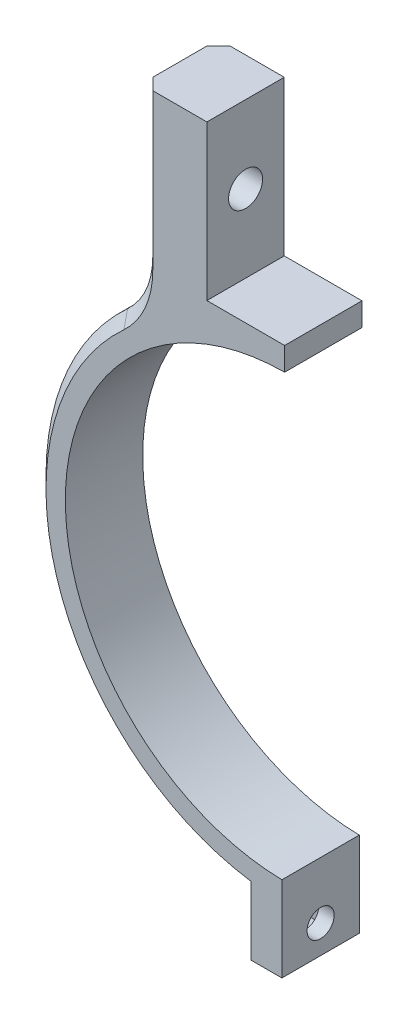
ISO-10303-21;
HEADER;
FILE_DESCRIPTION(('STEP AP214'),'2;1');
FILE_NAME('part.step','',(''),(''),'','','');
FILE_SCHEMA(('AUTOMOTIVE_DESIGN { 1 0 10303 214 1 1 1 1 }'));
ENDSEC;
DATA;
#1=APPLICATION_CONTEXT('core data for automotive mechanical design processes');
#2=APPLICATION_PROTOCOL_DEFINITION('international standard','automotive_design',2000,#1);
#3=PRODUCT_CONTEXT('',#1,'mechanical');
#4=PRODUCT('Part','Part','',(#3));
#5=PRODUCT_RELATED_PRODUCT_CATEGORY('part','',(#4));
#6=PRODUCT_DEFINITION_FORMATION('','',#4);
#7=PRODUCT_DEFINITION_CONTEXT('part definition',#1,'design');
#8=PRODUCT_DEFINITION('design','',#6,#7);
#9=PRODUCT_DEFINITION_SHAPE('','',#8);
#10=(LENGTH_UNIT() NAMED_UNIT(*) SI_UNIT(.MILLI.,.METRE.));
#11=(NAMED_UNIT(*) PLANE_ANGLE_UNIT() SI_UNIT($,.RADIAN.));
#12=(NAMED_UNIT(*) SI_UNIT($,.STERADIAN.) SOLID_ANGLE_UNIT());
#13=UNCERTAINTY_MEASURE_WITH_UNIT(LENGTH_MEASURE(1.E-05),#10,'distance_accuracy_value','');
#14=(GEOMETRIC_REPRESENTATION_CONTEXT(3) GLOBAL_UNCERTAINTY_ASSIGNED_CONTEXT((#13)) GLOBAL_UNIT_ASSIGNED_CONTEXT((#10,
#11,#12)) REPRESENTATION_CONTEXT('',''));
#15=CARTESIAN_POINT('',(0.,0.,0.));
#16=DIRECTION('',(0.,0.,1.));
#17=DIRECTION('',(1.,0.,0.));
#18=AXIS2_PLACEMENT_3D('',#15,#16,#17);
#19=CARTESIAN_POINT('',(-10.2,31.5,10.));
#20=DIRECTION('',(0.,-1.,0.));
#21=DIRECTION('',(0.,0.,-1.));
#22=AXIS2_PLACEMENT_3D('',#19,#20,#21);
#23=PLANE('',#22);
#24=DIRECTION('',(0.,0.,1.));
#25=VECTOR('',#24,1.);
#26=CARTESIAN_POINT('',(-0.149999999999999,31.5,10.));
#27=LINE('',#26,#25);
#28=CARTESIAN_POINT('',(-0.15,31.5,0.));
#29=VERTEX_POINT('',#28);
#30=CARTESIAN_POINT('',(-0.15,31.5,10.));
#31=VERTEX_POINT('',#30);
#32=EDGE_CURVE('E170',#29,#31,#27,.T.);
#33=ORIENTED_EDGE('',*,*,#32,.F.);
#34=DIRECTION('',(-1.,0.,0.));
#35=VECTOR('',#34,1.);
#36=CARTESIAN_POINT('',(-10.2,31.5,0.));
#37=LINE('',#36,#35);
#38=CARTESIAN_POINT('',(-10.2,31.5,0.));
#39=VERTEX_POINT('',#38);
#40=EDGE_CURVE('E213',#29,#39,#37,.T.);
#41=ORIENTED_EDGE('',*,*,#40,.T.);
#42=DIRECTION('',(0.,0.,-1.));
#43=VECTOR('',#42,1.);
#44=CARTESIAN_POINT('',(-10.2,31.5,10.));
#45=LINE('',#44,#43);
#46=CARTESIAN_POINT('',(-10.2,31.5,10.));
#47=VERTEX_POINT('',#46);
#48=EDGE_CURVE('E188',#47,#39,#45,.T.);
#49=ORIENTED_EDGE('',*,*,#48,.F.);
#50=DIRECTION('',(-1.,0.,0.));
#51=VECTOR('',#50,1.);
#52=CARTESIAN_POINT('',(-10.2,31.5,10.));
#53=LINE('',#52,#51);
#54=EDGE_CURVE('E182',#31,#47,#53,.T.);
#55=ORIENTED_EDGE('',*,*,#54,.F.);
#56=EDGE_LOOP('',(#33,#41,#49,#55));
#57=FACE_BOUND('',#56,.T.);
#58=ADVANCED_FACE('F36',(#57),#23,.F.);
#59=CARTESIAN_POINT('',(0.,0.,10.));
#60=DIRECTION('',(0.,0.,-1.));
#61=DIRECTION('',(-1.,0.,0.));
#62=AXIS2_PLACEMENT_3D('',#59,#60,#61);
#63=CYLINDRICAL_SURFACE('',#62,28.5);
#64=DIRECTION('',(0.,0.,-1.));
#65=VECTOR('',#64,1.);
#66=CARTESIAN_POINT('',(-0.15,28.4996052604242,10.));
#67=LINE('',#66,#65);
#68=CARTESIAN_POINT('',(-0.15,28.4996052604242,10.));
#69=VERTEX_POINT('',#68);
#70=CARTESIAN_POINT('',(-0.15,28.4996052604242,0.));
#71=VERTEX_POINT('',#70);
#72=EDGE_CURVE('E55',#69,#71,#67,.T.);
#73=ORIENTED_EDGE('',*,*,#72,.F.);
#74=CARTESIAN_POINT('',(0.,0.,10.));
#75=DIRECTION('',(0.,0.,-1.));
#76=DIRECTION('',(1.,0.,0.));
#77=AXIS2_PLACEMENT_3D('',#74,#75,#76);
#78=CIRCLE('',#77,28.5);
#79=CARTESIAN_POINT('',(-0.499999999999976,-28.49561369755,10.));
#80=VERTEX_POINT('',#79);
#81=EDGE_CURVE('E185',#80,#69,#78,.T.);
#82=ORIENTED_EDGE('',*,*,#81,.F.);
#83=DIRECTION('',(0.,0.,-1.));
#84=VECTOR('',#83,1.);
#85=CARTESIAN_POINT('',(-0.499999999999976,-28.49561369755,10.));
#86=LINE('',#85,#84);
#87=CARTESIAN_POINT('',(-0.499999999999976,-28.49561369755,0.));
#88=VERTEX_POINT('',#87);
#89=EDGE_CURVE('E212',#80,#88,#86,.T.);
#90=ORIENTED_EDGE('',*,*,#89,.T.);
#91=CARTESIAN_POINT('',(0.,0.,0.));
#92=DIRECTION('',(0.,0.,-1.));
#93=DIRECTION('',(1.,0.,0.));
#94=AXIS2_PLACEMENT_3D('',#91,#92,#93);
#95=CIRCLE('',#94,28.5);
#96=EDGE_CURVE('E191',#88,#71,#95,.T.);
#97=ORIENTED_EDGE('',*,*,#96,.T.);
#98=EDGE_LOOP('',(#73,#82,#90,#97));
#99=FACE_BOUND('',#98,.T.);
#100=ADVANCED_FACE('F335',(#99),#63,.F.);
#101=CARTESIAN_POINT('',(0.,0.,10.));
#102=DIRECTION('',(0.,0.,1.));
#103=DIRECTION('',(1.,0.,0.));
#104=AXIS2_PLACEMENT_3D('',#101,#102,#103);
#105=PLANE('',#104);
#106=ORIENTED_EDGE('',*,*,#81,.T.);
#107=DIRECTION('',(0.,-1.,0.));
#108=VECTOR('',#107,1.);
#109=CARTESIAN_POINT('',(-0.15,27.478555262615,10.));
#110=LINE('',#109,#108);
#111=EDGE_CURVE('E173',#31,#69,#110,.T.);
#112=ORIENTED_EDGE('',*,*,#111,.F.);
#113=ORIENTED_EDGE('',*,*,#54,.T.);
#114=DIRECTION('',(0.,1.,0.));
#115=VECTOR('',#114,1.);
#116=CARTESIAN_POINT('',(-10.2,31.5,10.));
#117=LINE('',#116,#115);
#118=CARTESIAN_POINT('',(-10.2,51.5,10.));
#119=VERTEX_POINT('',#118);
#120=EDGE_CURVE('E190',#47,#119,#117,.T.);
#121=ORIENTED_EDGE('',*,*,#120,.T.);
#122=DIRECTION('',(-1.,0.,0.));
#123=VECTOR('',#122,1.);
#124=CARTESIAN_POINT('',(-10.2,51.5,10.));
#125=LINE('',#124,#123);
#126=CARTESIAN_POINT('',(-17.2,51.5,10.));
#127=VERTEX_POINT('',#126);
#128=EDGE_CURVE('E193',#119,#127,#125,.T.);
#129=ORIENTED_EDGE('',*,*,#128,.T.);
#130=DIRECTION('',(0.,-1.,0.));
#131=VECTOR('',#130,1.);
#132=CARTESIAN_POINT('',(-17.2,31.3458131175441,10.));
#133=LINE('',#132,#131);
#134=CARTESIAN_POINT('',(-17.2,31.3458131175441,10.));
#135=VERTEX_POINT('',#134);
#136=EDGE_CURVE('E285',#127,#135,#133,.T.);
#137=ORIENTED_EDGE('',*,*,#136,.T.);
#138=CARTESIAN_POINT('',(-28.7,31.3458131175441,10.));
#139=DIRECTION('',(0.,0.,1.));
#140=DIRECTION('',(1.,0.,0.));
#141=AXIS2_PLACEMENT_3D('',#138,#139,#140);
#142=CIRCLE('',#141,11.5);
#143=CARTESIAN_POINT('',(-20.9341176470588,22.8640048622086,10.));
#144=VERTEX_POINT('',#143);
#145=EDGE_CURVE('E283',#135,#144,#142,.F.);
#146=ORIENTED_EDGE('',*,*,#145,.T.);
#147=CARTESIAN_POINT('',(0.,0.,10.));
#148=DIRECTION('',(0.,0.,1.));
#149=DIRECTION('',(1.,0.,0.));
#150=AXIS2_PLACEMENT_3D('',#147,#148,#149);
#151=CIRCLE('',#150,31.);
#152=CARTESIAN_POINT('',(-4.5,-30.67164814613,10.));
#153=VERTEX_POINT('',#152);
#154=EDGE_CURVE('E280',#144,#153,#151,.T.);
#155=ORIENTED_EDGE('',*,*,#154,.T.);
#156=DIRECTION('',(0.,-1.,0.));
#157=VECTOR('',#156,1.);
#158=CARTESIAN_POINT('',(-4.49999999999999,-39.4961536185438,10.));
#159=LINE('',#158,#157);
#160=CARTESIAN_POINT('',(-4.49999999999999,-39.4961536185438,10.));
#161=VERTEX_POINT('',#160);
#162=EDGE_CURVE('E204',#153,#161,#159,.T.);
#163=ORIENTED_EDGE('',*,*,#162,.T.);
#164=DIRECTION('',(1.,0.,0.));
#165=VECTOR('',#164,1.);
#166=CARTESIAN_POINT('',(-0.499999999999995,-39.4961536185438,10.));
#167=LINE('',#166,#165);
#168=CARTESIAN_POINT('',(-0.499999999999995,-39.4961536185438,10.));
#169=VERTEX_POINT('',#168);
#170=EDGE_CURVE('E206',#161,#169,#167,.T.);
#171=ORIENTED_EDGE('',*,*,#170,.T.);
#172=DIRECTION('',(0.,1.,0.));
#173=VECTOR('',#172,1.);
#174=CARTESIAN_POINT('',(-0.499999999999996,-32.4961536185438,10.));
#175=LINE('',#174,#173);
#176=EDGE_CURVE('E208',#169,#80,#175,.T.);
#177=ORIENTED_EDGE('',*,*,#176,.T.);
#178=EDGE_LOOP('',(#106,#112,#113,#121,#129,#137,#146,#155,#163,#171,#177));
#179=FACE_BOUND('',#178,.T.);
#180=ADVANCED_FACE('F181',(#179),#105,.T.);
#181=CARTESIAN_POINT('',(0.,0.,0.));
#182=DIRECTION('',(0.,0.,1.));
#183=DIRECTION('',(1.,0.,0.));
#184=AXIS2_PLACEMENT_3D('',#181,#182,#183);
#185=PLANE('',#184);
#186=DIRECTION('',(0.,-1.,0.));
#187=VECTOR('',#186,1.);
#188=CARTESIAN_POINT('',(-0.15,27.478555262615,0.));
#189=LINE('',#188,#187);
#190=EDGE_CURVE('E174',#29,#71,#189,.T.);
#191=ORIENTED_EDGE('',*,*,#190,.T.);
#192=ORIENTED_EDGE('',*,*,#96,.F.);
#193=DIRECTION('',(0.,1.,0.));
#194=VECTOR('',#193,1.);
#195=CARTESIAN_POINT('',(-0.499999999999997,-28.49561369755,0.));
#196=LINE('',#195,#194);
#197=CARTESIAN_POINT('',(-0.499999999999995,-39.4961536185438,0.));
#198=VERTEX_POINT('',#197);
#199=EDGE_CURVE('E196',#198,#88,#196,.T.);
#200=ORIENTED_EDGE('',*,*,#199,.F.);
#201=DIRECTION('',(1.,0.,0.));
#202=VECTOR('',#201,1.);
#203=CARTESIAN_POINT('',(-0.499999999999995,-39.4961536185438,0.));
#204=LINE('',#203,#202);
#205=CARTESIAN_POINT('',(-4.49999999999999,-39.4961536185438,0.));
#206=VERTEX_POINT('',#205);
#207=EDGE_CURVE('E222',#206,#198,#204,.T.);
#208=ORIENTED_EDGE('',*,*,#207,.F.);
#209=DIRECTION('',(0.,-1.,0.));
#210=VECTOR('',#209,1.);
#211=CARTESIAN_POINT('',(-4.49999999999999,-39.4961536185438,0.));
#212=LINE('',#211,#210);
#213=CARTESIAN_POINT('',(-4.5,-30.67164814613,0.));
#214=VERTEX_POINT('',#213);
#215=EDGE_CURVE('E220',#214,#206,#212,.T.);
#216=ORIENTED_EDGE('',*,*,#215,.F.);
#217=CARTESIAN_POINT('',(0.,0.,0.));
#218=DIRECTION('',(0.,0.,1.));
#219=DIRECTION('',(1.,0.,0.));
#220=AXIS2_PLACEMENT_3D('',#217,#218,#219);
#221=CIRCLE('',#220,31.);
#222=CARTESIAN_POINT('',(-20.9341176470588,22.8640048622086,0.));
#223=VERTEX_POINT('',#222);
#224=EDGE_CURVE('E261',#214,#223,#221,.F.);
#225=ORIENTED_EDGE('',*,*,#224,.T.);
#226=CARTESIAN_POINT('',(-28.7,31.3458131175441,0.));
#227=DIRECTION('',(0.,0.,1.));
#228=DIRECTION('',(1.,0.,0.));
#229=AXIS2_PLACEMENT_3D('',#226,#227,#228);
#230=CIRCLE('',#229,11.5);
#231=CARTESIAN_POINT('',(-17.2,31.3458131175441,0.));
#232=VERTEX_POINT('',#231);
#233=EDGE_CURVE('E263',#223,#232,#230,.T.);
#234=ORIENTED_EDGE('',*,*,#233,.T.);
#235=DIRECTION('',(0.,1.,0.));
#236=VECTOR('',#235,1.);
#237=CARTESIAN_POINT('',(-17.2,0.,0.));
#238=LINE('',#237,#236);
#239=CARTESIAN_POINT('',(-17.2,51.5,0.));
#240=VERTEX_POINT('',#239);
#241=EDGE_CURVE('E265',#232,#240,#238,.T.);
#242=ORIENTED_EDGE('',*,*,#241,.T.);
#243=DIRECTION('',(-1.,0.,0.));
#244=VECTOR('',#243,1.);
#245=CARTESIAN_POINT('',(-10.2,51.5,0.));
#246=LINE('',#245,#244);
#247=CARTESIAN_POINT('',(-10.2,51.5,0.));
#248=VERTEX_POINT('',#247);
#249=EDGE_CURVE('E217',#248,#240,#246,.T.);
#250=ORIENTED_EDGE('',*,*,#249,.F.);
#251=DIRECTION('',(0.,1.,0.));
#252=VECTOR('',#251,1.);
#253=CARTESIAN_POINT('',(-10.2,31.5,0.));
#254=LINE('',#253,#252);
#255=EDGE_CURVE('E215',#39,#248,#254,.T.);
#256=ORIENTED_EDGE('',*,*,#255,.F.);
#257=ORIENTED_EDGE('',*,*,#40,.F.);
#258=EDGE_LOOP('',(#191,#192,#200,#208,#216,#225,#234,#242,#250,#256,#257));
#259=FACE_BOUND('',#258,.T.);
#260=ADVANCED_FACE('F399',(#259),#185,.F.);
#261=CARTESIAN_POINT('',(-10.2,31.5,10.));
#262=DIRECTION('',(-1.,0.,0.));
#263=DIRECTION('',(0.,0.,1.));
#264=AXIS2_PLACEMENT_3D('',#261,#262,#263);
#265=PLANE('',#264);
#266=CARTESIAN_POINT('',(-10.2,41.5,5.));
#267=DIRECTION('',(-1.,0.,0.));
#268=DIRECTION('',(0.,0.,1.));
#269=AXIS2_PLACEMENT_3D('',#266,#267,#268);
#270=CIRCLE('',#269,2.2);
#271=CARTESIAN_POINT('',(-10.2,41.5,7.2));
#272=VERTEX_POINT('',#271);
#273=EDGE_CURVE('E444',#272,#272,#270,.T.);
#274=ORIENTED_EDGE('',*,*,#273,.T.);
#275=EDGE_LOOP('',(#274));
#276=FACE_BOUND('',#275,.T.);
#277=ORIENTED_EDGE('',*,*,#255,.T.);
#278=DIRECTION('',(0.,0.,-1.));
#279=VECTOR('',#278,1.);
#280=CARTESIAN_POINT('',(-10.2,51.5,10.));
#281=LINE('',#280,#279);
#282=EDGE_CURVE('E241',#119,#248,#281,.T.);
#283=ORIENTED_EDGE('',*,*,#282,.F.);
#284=ORIENTED_EDGE('',*,*,#120,.F.);
#285=ORIENTED_EDGE('',*,*,#48,.T.);
#286=EDGE_LOOP('',(#277,#283,#284,#285));
#287=FACE_BOUND('',#286,.T.);
#288=ADVANCED_FACE('F344',(#276,#287),#265,.F.);
#289=CARTESIAN_POINT('',(-10.2,51.5,10.));
#290=DIRECTION('',(0.,-1.,0.));
#291=DIRECTION('',(0.,0.,-1.));
#292=AXIS2_PLACEMENT_3D('',#289,#290,#291);
#293=PLANE('',#292);
#294=ORIENTED_EDGE('',*,*,#249,.T.);
#295=DIRECTION('',(0.707106781186552,0.,-0.707106781186543));
#296=VECTOR('',#295,1.);
#297=CARTESIAN_POINT('',(-18.7,51.5,1.49999999999999));
#298=LINE('',#297,#296);
#299=CARTESIAN_POINT('',(-18.7,51.5,1.49999999999999));
#300=VERTEX_POINT('',#299);
#301=EDGE_CURVE('E270',#240,#300,#298,.F.);
#302=ORIENTED_EDGE('',*,*,#301,.T.);
#303=DIRECTION('',(0.,0.,-1.));
#304=VECTOR('',#303,1.);
#305=CARTESIAN_POINT('',(-18.7,51.5,10.));
#306=LINE('',#305,#304);
#307=CARTESIAN_POINT('',(-18.7,51.5,8.50000000000001));
#308=VERTEX_POINT('',#307);
#309=EDGE_CURVE('E238',#308,#300,#306,.T.);
#310=ORIENTED_EDGE('',*,*,#309,.F.);
#311=DIRECTION('',(0.707106781186549,0.,0.707106781186546));
#312=VECTOR('',#311,1.);
#313=CARTESIAN_POINT('',(-17.2,51.5,10.));
#314=LINE('',#313,#312);
#315=EDGE_CURVE('E268',#308,#127,#314,.T.);
#316=ORIENTED_EDGE('',*,*,#315,.T.);
#317=ORIENTED_EDGE('',*,*,#128,.F.);
#318=ORIENTED_EDGE('',*,*,#282,.T.);
#319=EDGE_LOOP('',(#294,#302,#310,#316,#317,#318));
#320=FACE_BOUND('',#319,.T.);
#321=ADVANCED_FACE('F366',(#320),#293,.F.);
#322=CARTESIAN_POINT('',(-18.7,51.5,10.));
#323=DIRECTION('',(1.,0.,0.));
#324=DIRECTION('',(0.,0.,-1.));
#325=AXIS2_PLACEMENT_3D('',#322,#323,#324);
#326=PLANE('',#325);
#327=CARTESIAN_POINT('',(-18.7,41.5,5.));
#328=DIRECTION('',(-1.,0.,0.));
#329=DIRECTION('',(0.,-1.,0.));
#330=AXIS2_PLACEMENT_3D('',#327,#328,#329);
#331=CIRCLE('',#330,2.2);
#332=CARTESIAN_POINT('',(-18.7,39.3,5.));
#333=VERTEX_POINT('',#332);
#334=EDGE_CURVE('E255',#333,#333,#331,.T.);
#335=ORIENTED_EDGE('',*,*,#334,.F.);
#336=EDGE_LOOP('',(#335));
#337=FACE_BOUND('',#336,.T.);
#338=ORIENTED_EDGE('',*,*,#309,.T.);
#339=DIRECTION('',(0.,-1.,0.));
#340=VECTOR('',#339,1.);
#341=CARTESIAN_POINT('',(-18.7,51.5,1.49999999999999));
#342=LINE('',#341,#340);
#343=CARTESIAN_POINT('',(-18.7,31.3458131175441,1.49999999999999));
#344=VERTEX_POINT('',#343);
#345=EDGE_CURVE('E258',#300,#344,#342,.T.);
#346=ORIENTED_EDGE('',*,*,#345,.T.);
#347=DIRECTION('',(0.,0.,1.));
#348=VECTOR('',#347,1.);
#349=CARTESIAN_POINT('',(-18.7,31.3458131175441,10.));
#350=LINE('',#349,#348);
#351=CARTESIAN_POINT('',(-18.7,31.3458131175441,8.50000000000001));
#352=VERTEX_POINT('',#351);
#353=EDGE_CURVE('E248',#344,#352,#350,.T.);
#354=ORIENTED_EDGE('',*,*,#353,.T.);
#355=DIRECTION('',(0.,1.,0.));
#356=VECTOR('',#355,1.);
#357=CARTESIAN_POINT('',(-18.7,51.5,8.50000000000001));
#358=LINE('',#357,#356);
#359=EDGE_CURVE('E251',#352,#308,#358,.T.);
#360=ORIENTED_EDGE('',*,*,#359,.T.);
#361=EDGE_LOOP('',(#338,#346,#354,#360));
#362=FACE_BOUND('',#361,.T.);
#363=ADVANCED_FACE('F370',(#337,#362),#326,.F.);
#364=CARTESIAN_POINT('',(0.,0.,10.));
#365=DIRECTION('',(0.,0.,-1.));
#366=DIRECTION('',(-1.,0.,0.));
#367=AXIS2_PLACEMENT_3D('',#364,#365,#366);
#368=CYLINDRICAL_SURFACE('',#367,32.5);
#369=DIRECTION('',(0.,0.,-1.));
#370=VECTOR('',#369,1.);
#371=CARTESIAN_POINT('',(-21.9470588235294,23.970327678122,10.));
#372=LINE('',#371,#370);
#373=CARTESIAN_POINT('',(-21.9470588235294,23.970327678122,8.50000000000001));
#374=VERTEX_POINT('',#373);
#375=CARTESIAN_POINT('',(-21.9470588235294,23.970327678122,1.49999999999999));
#376=VERTEX_POINT('',#375);
#377=EDGE_CURVE('E245',#374,#376,#372,.T.);
#378=ORIENTED_EDGE('',*,*,#377,.T.);
#379=CARTESIAN_POINT('',(0.,0.,1.49999999999999));
#380=DIRECTION('',(0.,0.,1.));
#381=DIRECTION('',(1.,0.,0.));
#382=AXIS2_PLACEMENT_3D('',#379,#380,#381);
#383=CIRCLE('',#382,32.5);
#384=CARTESIAN_POINT('',(-4.5,-32.1869538788622,1.49999999999999));
#385=VERTEX_POINT('',#384);
#386=EDGE_CURVE('E278',#376,#385,#383,.T.);
#387=ORIENTED_EDGE('',*,*,#386,.T.);
#388=DIRECTION('',(0.,0.,-1.));
#389=VECTOR('',#388,1.);
#390=CARTESIAN_POINT('',(-4.5,-32.1869538788622,10.));
#391=LINE('',#390,#389);
#392=CARTESIAN_POINT('',(-4.5,-32.1869538788622,8.50000000000001));
#393=VERTEX_POINT('',#392);
#394=EDGE_CURVE('E235',#393,#385,#391,.T.);
#395=ORIENTED_EDGE('',*,*,#394,.F.);
#396=CARTESIAN_POINT('',(0.,0.,8.50000000000001));
#397=DIRECTION('',(0.,0.,1.));
#398=DIRECTION('',(1.,0.,0.));
#399=AXIS2_PLACEMENT_3D('',#396,#397,#398);
#400=CIRCLE('',#399,32.5);
#401=EDGE_CURVE('E276',#393,#374,#400,.F.);
#402=ORIENTED_EDGE('',*,*,#401,.T.);
#403=EDGE_LOOP('',(#378,#387,#395,#402));
#404=FACE_BOUND('',#403,.T.);
#405=ADVANCED_FACE('F385',(#404),#368,.T.);
#406=CARTESIAN_POINT('',(-4.49999999999999,-39.4961536185438,10.));
#407=DIRECTION('',(1.,0.,0.));
#408=DIRECTION('',(0.,1.,0.));
#409=AXIS2_PLACEMENT_3D('',#406,#407,#408);
#410=PLANE('',#409);
#411=DIRECTION('',(0.,0.,-1.));
#412=VECTOR('',#411,1.);
#413=CARTESIAN_POINT('',(-4.5,-33.091553748703,2.25));
#414=LINE('',#413,#412);
#415=CARTESIAN_POINT('',(-4.5,-33.091553748703,7.75));
#416=VERTEX_POINT('',#415);
#417=CARTESIAN_POINT('',(-4.5,-33.091553748703,2.25));
#418=VERTEX_POINT('',#417);
#419=EDGE_CURVE('E428',#416,#418,#414,.T.);
#420=ORIENTED_EDGE('',*,*,#419,.F.);
#421=DIRECTION('',(0.,1.,0.));
#422=VECTOR('',#421,1.);
#423=CARTESIAN_POINT('',(-4.49999999999999,-38.591553748703,7.75));
#424=LINE('',#423,#422);
#425=CARTESIAN_POINT('',(-4.49999999999999,-38.591553748703,7.75));
#426=VERTEX_POINT('',#425);
#427=EDGE_CURVE('E377',#426,#416,#424,.T.);
#428=ORIENTED_EDGE('',*,*,#427,.F.);
#429=DIRECTION('',(0.,0.,1.));
#430=VECTOR('',#429,1.);
#431=CARTESIAN_POINT('',(-4.49999999999999,-38.591553748703,2.25));
#432=LINE('',#431,#430);
#433=CARTESIAN_POINT('',(-4.49999999999999,-38.591553748703,2.25));
#434=VERTEX_POINT('',#433);
#435=EDGE_CURVE('E417',#434,#426,#432,.T.);
#436=ORIENTED_EDGE('',*,*,#435,.F.);
#437=DIRECTION('',(0.,-1.,0.));
#438=VECTOR('',#437,1.);
#439=CARTESIAN_POINT('',(-4.49999999999999,-38.591553748703,2.25));
#440=LINE('',#439,#438);
#441=EDGE_CURVE('E431',#418,#434,#440,.T.);
#442=ORIENTED_EDGE('',*,*,#441,.F.);
#443=EDGE_LOOP('',(#420,#428,#436,#442));
#444=FACE_BOUND('',#443,.T.);
#445=ORIENTED_EDGE('',*,*,#215,.T.);
#446=DIRECTION('',(0.,0.,-1.));
#447=VECTOR('',#446,1.);
#448=CARTESIAN_POINT('',(-4.49999999999999,-39.4961536185438,10.));
#449=LINE('',#448,#447);
#450=EDGE_CURVE('E232',#161,#206,#449,.T.);
#451=ORIENTED_EDGE('',*,*,#450,.F.);
#452=ORIENTED_EDGE('',*,*,#162,.F.);
#453=CARTESIAN_POINT('',(-4.5,-30.67164814613,10.));
#454=CARTESIAN_POINT('',(-4.5,-30.9242596647789,9.75006118099454));
#455=CARTESIAN_POINT('',(-4.5,-31.1768409018748,9.50009177144847));
#456=CARTESIAN_POINT('',(-4.5,-31.6819428127855,9.00009177144844));
#457=CARTESIAN_POINT('',(-4.5,-31.9344634866003,8.7500611809945));
#458=CARTESIAN_POINT('',(-4.5,-32.1869538788622,8.50000000000001));
#459=B_SPLINE_CURVE_WITH_KNOTS('',3,(#453,#454,#455,#456,#457,#458),.UNSPECIFIED.,.F.,.F.,(4,2,
4),(0.,1.06608530773822,2.13217061473749),.UNSPECIFIED.);
#460=EDGE_CURVE('E11',#153,#393,#459,.T.);
#461=ORIENTED_EDGE('',*,*,#460,.T.);
#462=ORIENTED_EDGE('',*,*,#394,.T.);
#463=CARTESIAN_POINT('',(-4.5,-32.1869538788622,1.49999999999999));
#464=CARTESIAN_POINT('',(-4.5,-31.9344634866003,1.2499388190055));
#465=CARTESIAN_POINT('',(-4.5,-31.6819428127855,0.999908228551563));
#466=CARTESIAN_POINT('',(-4.5,-31.1768409018748,0.499908228551526));
#467=CARTESIAN_POINT('',(-4.5,-30.9242596647789,0.249938819005463));
#468=CARTESIAN_POINT('',(-4.5,-30.67164814613,0.));
#469=B_SPLINE_CURVE_WITH_KNOTS('',3,(#463,#464,#465,#466,#467,#468),.UNSPECIFIED.,.F.,.F.,(4,2,
4),(0.,1.06608530699927,2.13217061473749),.UNSPECIFIED.);
#470=EDGE_CURVE('E47',#385,#214,#469,.T.);
#471=ORIENTED_EDGE('',*,*,#470,.T.);
#472=EDGE_LOOP('',(#445,#451,#452,#461,#462,#471));
#473=FACE_BOUND('',#472,.T.);
#474=ADVANCED_FACE('F300',(#444,#473),#410,.F.);
#475=CARTESIAN_POINT('',(-0.499999999999995,-39.4961536185438,10.));
#476=DIRECTION('',(0.,1.,0.));
#477=DIRECTION('',(0.,0.,1.));
#478=AXIS2_PLACEMENT_3D('',#475,#476,#477);
#479=PLANE('',#478);
#480=ORIENTED_EDGE('',*,*,#207,.T.);
#481=DIRECTION('',(0.,0.,-1.));
#482=VECTOR('',#481,1.);
#483=CARTESIAN_POINT('',(-0.499999999999995,-39.4961536185438,10.));
#484=LINE('',#483,#482);
#485=EDGE_CURVE('E229',#169,#198,#484,.T.);
#486=ORIENTED_EDGE('',*,*,#485,.F.);
#487=ORIENTED_EDGE('',*,*,#170,.F.);
#488=ORIENTED_EDGE('',*,*,#450,.T.);
#489=EDGE_LOOP('',(#480,#486,#487,#488));
#490=FACE_BOUND('',#489,.T.);
#491=ADVANCED_FACE('F404',(#490),#479,.F.);
#492=CARTESIAN_POINT('',(-0.499999999999997,-28.49561369755,10.));
#493=DIRECTION('',(-1.,0.,0.));
#494=DIRECTION('',(0.,-1.,0.));
#495=AXIS2_PLACEMENT_3D('',#492,#493,#494);
#496=PLANE('',#495);
#497=CARTESIAN_POINT('',(-0.499999999999994,-35.841553748703,5.));
#498=DIRECTION('',(-1.,0.,0.));
#499=DIRECTION('',(0.,-1.,0.));
#500=AXIS2_PLACEMENT_3D('',#497,#498,#499);
#501=CIRCLE('',#500,1.75);
#502=CARTESIAN_POINT('',(-0.499999999999993,-37.591553748703,5.));
#503=VERTEX_POINT('',#502);
#504=EDGE_CURVE('E199',#503,#503,#501,.T.);
#505=ORIENTED_EDGE('',*,*,#504,.T.);
#506=EDGE_LOOP('',(#505));
#507=FACE_BOUND('',#506,.T.);
#508=ORIENTED_EDGE('',*,*,#199,.T.);
#509=ORIENTED_EDGE('',*,*,#89,.F.);
#510=ORIENTED_EDGE('',*,*,#176,.F.);
#511=ORIENTED_EDGE('',*,*,#485,.T.);
#512=EDGE_LOOP('',(#508,#509,#510,#511));
#513=FACE_BOUND('',#512,.T.);
#514=ADVANCED_FACE('F408',(#507,#513),#496,.F.);
#515=CARTESIAN_POINT('',(32.5,-35.841553748703,5.));
#516=DIRECTION('',(-1.,0.,0.));
#517=DIRECTION('',(0.,0.,1.));
#518=AXIS2_PLACEMENT_3D('',#515,#516,#517);
#519=CYLINDRICAL_SURFACE('',#518,1.75);
#520=CARTESIAN_POINT('',(-2.5,-35.841553748703,5.));
#521=DIRECTION('',(1.,0.,0.));
#522=DIRECTION('',(0.,1.,0.));
#523=AXIS2_PLACEMENT_3D('',#520,#521,#522);
#524=CIRCLE('',#523,1.75);
#525=CARTESIAN_POINT('',(-2.5,-34.091553748703,5.));
#526=VERTEX_POINT('',#525);
#527=EDGE_CURVE('E252',#526,#526,#524,.F.);
#528=ORIENTED_EDGE('',*,*,#527,.T.);
#529=EDGE_LOOP('',(#528));
#530=FACE_BOUND('',#529,.T.);
#531=ORIENTED_EDGE('',*,*,#504,.F.);
#532=EDGE_LOOP('',(#531));
#533=FACE_BOUND('',#532,.T.);
#534=ADVANCED_FACE('F452',(#530,#533),#519,.F.);
#535=CARTESIAN_POINT('',(32.5,41.5,5.));
#536=DIRECTION('',(-1.,0.,0.));
#537=DIRECTION('',(0.,-1.,0.));
#538=AXIS2_PLACEMENT_3D('',#535,#536,#537);
#539=CYLINDRICAL_SURFACE('',#538,2.2);
#540=ORIENTED_EDGE('',*,*,#334,.T.);
#541=EDGE_LOOP('',(#540));
#542=FACE_BOUND('',#541,.T.);
#543=ORIENTED_EDGE('',*,*,#273,.F.);
#544=EDGE_LOOP('',(#543));
#545=FACE_BOUND('',#544,.T.);
#546=ADVANCED_FACE('F349',(#542,#545),#539,.F.);
#547=CARTESIAN_POINT('',(-28.7,31.3458131175441,10.));
#548=DIRECTION('',(0.,0.,-1.));
#549=DIRECTION('',(-1.,0.,0.));
#550=AXIS2_PLACEMENT_3D('',#547,#548,#549);
#551=CYLINDRICAL_SURFACE('',#550,10.);
#552=ORIENTED_EDGE('',*,*,#353,.F.);
#553=CARTESIAN_POINT('',(-28.7,31.3458131175441,1.49999999999999));
#554=DIRECTION('',(0.,0.,1.));
#555=DIRECTION('',(1.,0.,0.));
#556=AXIS2_PLACEMENT_3D('',#553,#554,#555);
#557=CIRCLE('',#556,10.);
#558=EDGE_CURVE('E274',#344,#376,#557,.F.);
#559=ORIENTED_EDGE('',*,*,#558,.T.);
#560=ORIENTED_EDGE('',*,*,#377,.F.);
#561=CARTESIAN_POINT('',(-28.7,31.3458131175441,8.50000000000001));
#562=DIRECTION('',(0.,0.,1.));
#563=DIRECTION('',(1.,0.,0.));
#564=AXIS2_PLACEMENT_3D('',#561,#562,#563);
#565=CIRCLE('',#564,10.);
#566=EDGE_CURVE('E272',#374,#352,#565,.T.);
#567=ORIENTED_EDGE('',*,*,#566,.T.);
#568=EDGE_LOOP('',(#552,#559,#560,#567));
#569=FACE_BOUND('',#568,.T.);
#570=ADVANCED_FACE('F346',(#569),#551,.F.);
#571=CARTESIAN_POINT('',(-2.50000000000001,0.,0.));
#572=DIRECTION('',(1.,0.,0.));
#573=DIRECTION('',(0.,1.,0.));
#574=AXIS2_PLACEMENT_3D('',#571,#572,#573);
#575=PLANE('',#574);
#576=DIRECTION('',(0.,1.,0.));
#577=VECTOR('',#576,1.);
#578=CARTESIAN_POINT('',(-2.49999999999999,-38.591553748703,7.75));
#579=LINE('',#578,#577);
#580=CARTESIAN_POINT('',(-2.49999999999999,-38.591553748703,7.75));
#581=VERTEX_POINT('',#580);
#582=CARTESIAN_POINT('',(-2.5,-33.091553748703,7.75));
#583=VERTEX_POINT('',#582);
#584=EDGE_CURVE('E413',#581,#583,#579,.T.);
#585=ORIENTED_EDGE('',*,*,#584,.T.);
#586=DIRECTION('',(0.,0.,-1.));
#587=VECTOR('',#586,1.);
#588=CARTESIAN_POINT('',(-2.5,-33.091553748703,2.25));
#589=LINE('',#588,#587);
#590=CARTESIAN_POINT('',(-2.5,-33.091553748703,2.25));
#591=VERTEX_POINT('',#590);
#592=EDGE_CURVE('E416',#583,#591,#589,.T.);
#593=ORIENTED_EDGE('',*,*,#592,.T.);
#594=DIRECTION('',(0.,-1.,0.));
#595=VECTOR('',#594,1.);
#596=CARTESIAN_POINT('',(-2.49999999999999,-38.591553748703,2.25));
#597=LINE('',#596,#595);
#598=CARTESIAN_POINT('',(-2.49999999999999,-38.591553748703,2.25));
#599=VERTEX_POINT('',#598);
#600=EDGE_CURVE('E420',#591,#599,#597,.T.);
#601=ORIENTED_EDGE('',*,*,#600,.T.);
#602=DIRECTION('',(0.,0.,1.));
#603=VECTOR('',#602,1.);
#604=CARTESIAN_POINT('',(-2.49999999999999,-38.591553748703,2.25));
#605=LINE('',#604,#603);
#606=EDGE_CURVE('E423',#599,#581,#605,.T.);
#607=ORIENTED_EDGE('',*,*,#606,.T.);
#608=EDGE_LOOP('',(#585,#593,#601,#607));
#609=FACE_BOUND('',#608,.T.);
#610=ORIENTED_EDGE('',*,*,#527,.F.);
#611=EDGE_LOOP('',(#610));
#612=FACE_BOUND('',#611,.T.);
#613=ADVANCED_FACE('F348',(#609,#612),#575,.F.);
#614=CARTESIAN_POINT('',(-2.49999999999999,-38.591553748703,7.75));
#615=DIRECTION('',(0.,0.,1.));
#616=DIRECTION('',(1.,0.,0.));
#617=AXIS2_PLACEMENT_3D('',#614,#615,#616);
#618=PLANE('',#617);
#619=ORIENTED_EDGE('',*,*,#427,.T.);
#620=DIRECTION('',(-1.,0.,0.));
#621=VECTOR('',#620,1.);
#622=CARTESIAN_POINT('',(-2.5,-33.091553748703,7.75));
#623=LINE('',#622,#621);
#624=EDGE_CURVE('E426',#583,#416,#623,.T.);
#625=ORIENTED_EDGE('',*,*,#624,.F.);
#626=ORIENTED_EDGE('',*,*,#584,.F.);
#627=DIRECTION('',(-1.,0.,0.));
#628=VECTOR('',#627,1.);
#629=CARTESIAN_POINT('',(-2.49999999999999,-38.591553748703,7.75));
#630=LINE('',#629,#628);
#631=EDGE_CURVE('E256',#581,#426,#630,.T.);
#632=ORIENTED_EDGE('',*,*,#631,.T.);
#633=EDGE_LOOP('',(#619,#625,#626,#632));
#634=FACE_BOUND('',#633,.T.);
#635=ADVANCED_FACE('F485',(#634),#618,.F.);
#636=CARTESIAN_POINT('',(-2.49999999999999,-38.591553748703,2.25));
#637=DIRECTION('',(0.,-1.,0.));
#638=DIRECTION('',(1.,0.,0.));
#639=AXIS2_PLACEMENT_3D('',#636,#637,#638);
#640=PLANE('',#639);
#641=ORIENTED_EDGE('',*,*,#435,.T.);
#642=ORIENTED_EDGE('',*,*,#631,.F.);
#643=ORIENTED_EDGE('',*,*,#606,.F.);
#644=DIRECTION('',(-1.,0.,0.));
#645=VECTOR('',#644,1.);
#646=CARTESIAN_POINT('',(-2.49999999999999,-38.591553748703,2.25));
#647=LINE('',#646,#645);
#648=EDGE_CURVE('E437',#599,#434,#647,.T.);
#649=ORIENTED_EDGE('',*,*,#648,.T.);
#650=EDGE_LOOP('',(#641,#642,#643,#649));
#651=FACE_BOUND('',#650,.T.);
#652=ADVANCED_FACE('F488',(#651),#640,.F.);
#653=CARTESIAN_POINT('',(-2.49999999999999,-38.591553748703,2.25));
#654=DIRECTION('',(0.,0.,-1.));
#655=DIRECTION('',(-1.,0.,0.));
#656=AXIS2_PLACEMENT_3D('',#653,#654,#655);
#657=PLANE('',#656);
#658=ORIENTED_EDGE('',*,*,#441,.T.);
#659=ORIENTED_EDGE('',*,*,#648,.F.);
#660=ORIENTED_EDGE('',*,*,#600,.F.);
#661=DIRECTION('',(-1.,0.,0.));
#662=VECTOR('',#661,1.);
#663=CARTESIAN_POINT('',(-2.5,-33.091553748703,2.25));
#664=LINE('',#663,#662);
#665=EDGE_CURVE('E439',#591,#418,#664,.T.);
#666=ORIENTED_EDGE('',*,*,#665,.T.);
#667=EDGE_LOOP('',(#658,#659,#660,#666));
#668=FACE_BOUND('',#667,.T.);
#669=ADVANCED_FACE('F490',(#668),#657,.F.);
#670=CARTESIAN_POINT('',(-2.5,-33.091553748703,2.25));
#671=DIRECTION('',(0.,1.,0.));
#672=DIRECTION('',(-1.,0.,0.));
#673=AXIS2_PLACEMENT_3D('',#670,#671,#672);
#674=PLANE('',#673);
#675=ORIENTED_EDGE('',*,*,#419,.T.);
#676=ORIENTED_EDGE('',*,*,#665,.F.);
#677=ORIENTED_EDGE('',*,*,#592,.F.);
#678=ORIENTED_EDGE('',*,*,#624,.T.);
#679=EDGE_LOOP('',(#675,#676,#677,#678));
#680=FACE_BOUND('',#679,.T.);
#681=ADVANCED_FACE('F314',(#680),#674,.F.);
#682=CARTESIAN_POINT('',(0.,0.,1.49999999999999));
#683=DIRECTION('',(0.,0.,1.));
#684=DIRECTION('',(1.,0.,0.));
#685=AXIS2_PLACEMENT_3D('',#682,#683,#684);
#686=CONICAL_SURFACE('',#685,32.5,0.785398163397454);
#687=ORIENTED_EDGE('',*,*,#470,.F.);
#688=ORIENTED_EDGE('',*,*,#386,.F.);
#689=DIRECTION('',(-0.477505049883623,0.521525576875807,0.707106781186544));
#690=VECTOR('',#689,1.);
#691=CARTESIAN_POINT('',(-20.9341176470588,22.8640048622086,0.));
#692=LINE('',#691,#690);
#693=EDGE_CURVE('E375',#223,#376,#692,.T.);
#694=ORIENTED_EDGE('',*,*,#693,.F.);
#695=ORIENTED_EDGE('',*,*,#224,.F.);
#696=EDGE_LOOP('',(#687,#688,#694,#695));
#697=FACE_BOUND('',#696,.T.);
#698=ADVANCED_FACE('F305',(#697),#686,.T.);
#699=CARTESIAN_POINT('',(-28.7,31.3458131175441,0.));
#700=DIRECTION('',(0.,0.,-1.));
#701=DIRECTION('',(-1.,0.,0.));
#702=AXIS2_PLACEMENT_3D('',#699,#700,#701);
#703=CONICAL_SURFACE('',#702,11.5,0.785398163397454);
#704=ORIENTED_EDGE('',*,*,#693,.T.);
#705=ORIENTED_EDGE('',*,*,#558,.F.);
#706=DIRECTION('',(-0.707106781186552,0.,0.707106781186543));
#707=VECTOR('',#706,1.);
#708=CARTESIAN_POINT('',(-17.2,31.3458131175441,0.));
#709=LINE('',#708,#707);
#710=EDGE_CURVE('E373',#232,#344,#709,.T.);
#711=ORIENTED_EDGE('',*,*,#710,.F.);
#712=ORIENTED_EDGE('',*,*,#233,.F.);
#713=EDGE_LOOP('',(#704,#705,#711,#712));
#714=FACE_BOUND('',#713,.T.);
#715=ADVANCED_FACE('F313',(#714),#703,.F.);
#716=CARTESIAN_POINT('',(-18.7,51.5,1.49999999999999));
#717=DIRECTION('',(0.707106781186543,0.,0.707106781186552));
#718=DIRECTION('',(0.,-1.,0.));
#719=AXIS2_PLACEMENT_3D('',#716,#717,#718);
#720=PLANE('',#719);
#721=ORIENTED_EDGE('',*,*,#301,.F.);
#722=ORIENTED_EDGE('',*,*,#241,.F.);
#723=ORIENTED_EDGE('',*,*,#710,.T.);
#724=ORIENTED_EDGE('',*,*,#345,.F.);
#725=EDGE_LOOP('',(#721,#722,#723,#724));
#726=FACE_BOUND('',#725,.T.);
#727=ADVANCED_FACE('F331',(#726),#720,.F.);
#728=CARTESIAN_POINT('',(0.,0.,10.));
#729=DIRECTION('',(0.,0.,-1.));
#730=DIRECTION('',(-1.,0.,0.));
#731=AXIS2_PLACEMENT_3D('',#728,#729,#730);
#732=CONICAL_SURFACE('',#731,31.,0.785398163397451);
#733=ORIENTED_EDGE('',*,*,#460,.F.);
#734=ORIENTED_EDGE('',*,*,#154,.F.);
#735=DIRECTION('',(0.477505049883623,-0.521525576875805,0.707106781186546));
#736=VECTOR('',#735,1.);
#737=CARTESIAN_POINT('',(-21.9470588235294,23.970327678122,8.50000000000001));
#738=LINE('',#737,#736);
#739=EDGE_CURVE('E42',#374,#144,#738,.T.);
#740=ORIENTED_EDGE('',*,*,#739,.F.);
#741=ORIENTED_EDGE('',*,*,#401,.F.);
#742=EDGE_LOOP('',(#733,#734,#740,#741));
#743=FACE_BOUND('',#742,.T.);
#744=ADVANCED_FACE('F39',(#743),#732,.T.);
#745=CARTESIAN_POINT('',(-28.7,31.3458131175441,10.));
#746=DIRECTION('',(0.,0.,1.));
#747=DIRECTION('',(1.,0.,0.));
#748=AXIS2_PLACEMENT_3D('',#745,#746,#747);
#749=CONICAL_SURFACE('',#748,11.5,0.785398163397451);
#750=ORIENTED_EDGE('',*,*,#739,.T.);
#751=ORIENTED_EDGE('',*,*,#145,.F.);
#752=DIRECTION('',(0.707106781186549,0.,0.707106781186546));
#753=VECTOR('',#752,1.);
#754=CARTESIAN_POINT('',(-18.7,31.3458131175441,8.50000000000001));
#755=LINE('',#754,#753);
#756=EDGE_CURVE('E63',#352,#135,#755,.T.);
#757=ORIENTED_EDGE('',*,*,#756,.F.);
#758=ORIENTED_EDGE('',*,*,#566,.F.);
#759=EDGE_LOOP('',(#750,#751,#757,#758));
#760=FACE_BOUND('',#759,.T.);
#761=ADVANCED_FACE('F323',(#760),#749,.F.);
#762=CARTESIAN_POINT('',(-17.2,0.,10.));
#763=DIRECTION('',(-0.707106781186546,0.,0.707106781186549));
#764=DIRECTION('',(0.,1.,0.));
#765=AXIS2_PLACEMENT_3D('',#762,#763,#764);
#766=PLANE('',#765);
#767=ORIENTED_EDGE('',*,*,#315,.F.);
#768=ORIENTED_EDGE('',*,*,#359,.F.);
#769=ORIENTED_EDGE('',*,*,#756,.T.);
#770=ORIENTED_EDGE('',*,*,#136,.F.);
#771=EDGE_LOOP('',(#767,#768,#769,#770));
#772=FACE_BOUND('',#771,.T.);
#773=ADVANCED_FACE('F318',(#772),#766,.T.);
#774=CARTESIAN_POINT('',(-0.15,27.478555262615,10.));
#775=DIRECTION('',(1.,0.,0.));
#776=DIRECTION('',(0.,0.,-1.));
#777=AXIS2_PLACEMENT_3D('',#774,#775,#776);
#778=PLANE('',#777);
#779=ORIENTED_EDGE('',*,*,#32,.T.);
#780=ORIENTED_EDGE('',*,*,#111,.T.);
#781=ORIENTED_EDGE('',*,*,#72,.T.);
#782=ORIENTED_EDGE('',*,*,#190,.F.);
#783=EDGE_LOOP('',(#779,#780,#781,#782));
#784=FACE_BOUND('',#783,.T.);
#785=ADVANCED_FACE('F172',(#784),#778,.T.);
#786=CLOSED_SHELL('',(#58,#100,#180,#260,#288,#321,#363,#405,#474,#491,#514,#534,#546,#570,#613,
#635,#652,#669,#681,#698,#715,#727,#744,#761,#773,#785));
#787=MANIFOLD_SOLID_BREP('B2',#786);
#788=ADVANCED_BREP_SHAPE_REPRESENTATION('',(#18,#787),#14);
#789=SHAPE_DEFINITION_REPRESENTATION(#9,#788);
ENDSEC;
END-ISO-10303-21;
